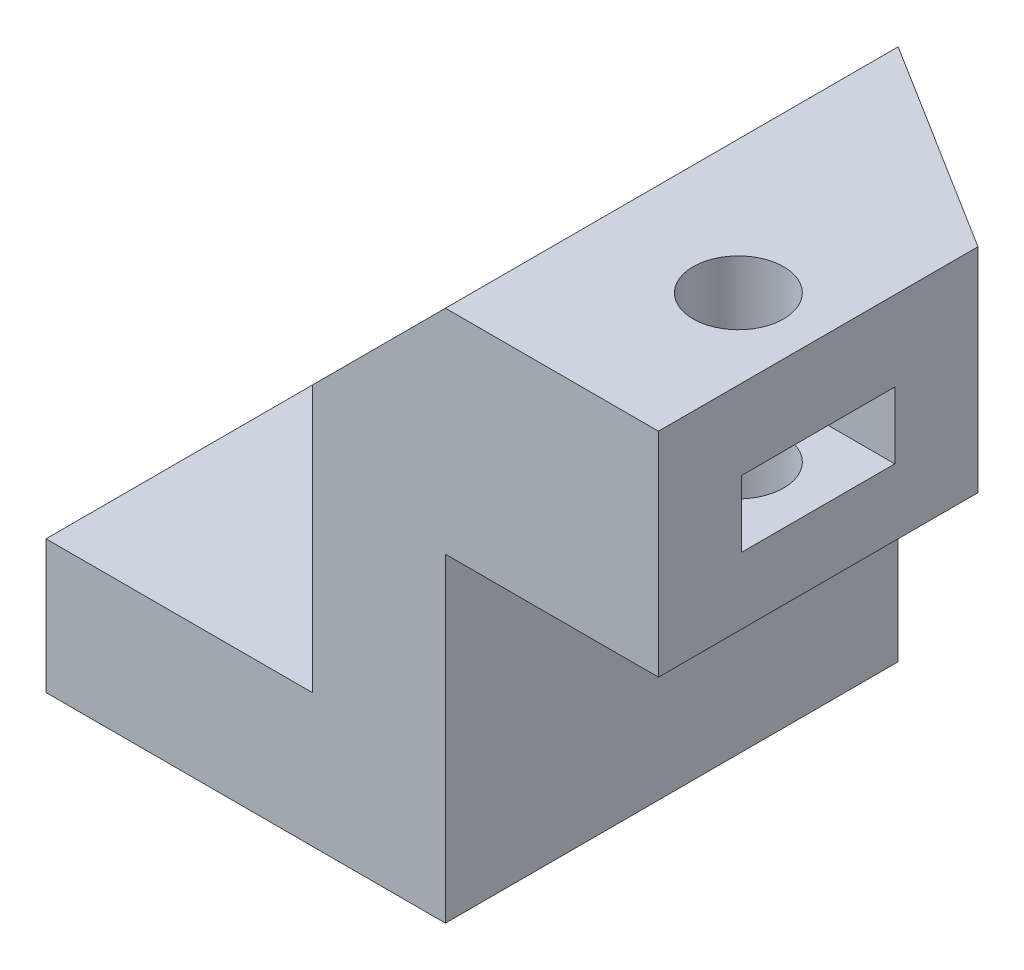
ISO-10303-21;
HEADER;
FILE_DESCRIPTION(('STEP AP214'),'2;1');
FILE_NAME('part.step','',(''),(''),'','','');
FILE_SCHEMA(('AUTOMOTIVE_DESIGN { 1 0 10303 214 1 1 1 1 }'));
ENDSEC;
DATA;
#1=APPLICATION_CONTEXT('core data for automotive mechanical design processes');
#2=APPLICATION_PROTOCOL_DEFINITION('international standard','automotive_design',2000,#1);
#3=PRODUCT_CONTEXT('',#1,'mechanical');
#4=PRODUCT('Part','Part','',(#3));
#5=PRODUCT_RELATED_PRODUCT_CATEGORY('part','',(#4));
#6=PRODUCT_DEFINITION_FORMATION('','',#4);
#7=PRODUCT_DEFINITION_CONTEXT('part definition',#1,'design');
#8=PRODUCT_DEFINITION('design','',#6,#7);
#9=PRODUCT_DEFINITION_SHAPE('','',#8);
#10=(LENGTH_UNIT() NAMED_UNIT(*) SI_UNIT(.MILLI.,.METRE.));
#11=(NAMED_UNIT(*) PLANE_ANGLE_UNIT() SI_UNIT($,.RADIAN.));
#12=(NAMED_UNIT(*) SI_UNIT($,.STERADIAN.) SOLID_ANGLE_UNIT());
#13=UNCERTAINTY_MEASURE_WITH_UNIT(LENGTH_MEASURE(1.E-05),#10,'distance_accuracy_value','');
#14=(GEOMETRIC_REPRESENTATION_CONTEXT(3) GLOBAL_UNCERTAINTY_ASSIGNED_CONTEXT((#13)) GLOBAL_UNIT_ASSIGNED_CONTEXT((#10,
#11,#12)) REPRESENTATION_CONTEXT('',''));
#15=CARTESIAN_POINT('',(0.,0.,0.));
#16=DIRECTION('',(0.,0.,1.));
#17=DIRECTION('',(1.,0.,0.));
#18=AXIS2_PLACEMENT_3D('',#15,#16,#17);
#19=CARTESIAN_POINT('',(23.,12.,-17.));
#20=DIRECTION('',(1.,0.,0.));
#21=DIRECTION('',(0.,0.,-1.));
#22=AXIS2_PLACEMENT_3D('',#19,#20,#21);
#23=PLANE('',#22);
#24=DIRECTION('',(0.,0.,1.));
#25=VECTOR('',#24,1.);
#26=CARTESIAN_POINT('',(23.,12.,-17.));
#27=LINE('',#26,#25);
#28=CARTESIAN_POINT('',(23.,12.,-12.));
#29=VERTEX_POINT('',#28);
#30=CARTESIAN_POINT('',(23.,12.,0.));
#31=VERTEX_POINT('',#30);
#32=EDGE_CURVE('E244',#29,#31,#27,.T.);
#33=ORIENTED_EDGE('',*,*,#32,.F.);
#34=DIRECTION('',(0.,1.,0.));
#35=VECTOR('',#34,1.);
#36=CARTESIAN_POINT('',(23.,20.,-12.));
#37=LINE('',#36,#35);
#38=CARTESIAN_POINT('',(23.,20.,-12.));
#39=VERTEX_POINT('',#38);
#40=EDGE_CURVE('E243',#29,#39,#37,.T.);
#41=ORIENTED_EDGE('',*,*,#40,.T.);
#42=DIRECTION('',(0.,0.,1.));
#43=VECTOR('',#42,1.);
#44=CARTESIAN_POINT('',(23.,20.,-17.));
#45=LINE('',#44,#43);
#46=CARTESIAN_POINT('',(23.,20.,0.));
#47=VERTEX_POINT('',#46);
#48=EDGE_CURVE('E241',#39,#47,#45,.T.);
#49=ORIENTED_EDGE('',*,*,#48,.T.);
#50=DIRECTION('',(0.,1.,0.));
#51=VECTOR('',#50,1.);
#52=CARTESIAN_POINT('',(23.,12.,0.));
#53=LINE('',#52,#51);
#54=EDGE_CURVE('E200',#31,#47,#53,.T.);
#55=ORIENTED_EDGE('',*,*,#54,.F.);
#56=EDGE_LOOP('',(#33,#41,#49,#55));
#57=FACE_BOUND('',#56,.T.);
#58=DIRECTION('',(0.,1.,0.));
#59=VECTOR('',#58,1.);
#60=CARTESIAN_POINT('',(23.,14.5,-8.875));
#61=LINE('',#60,#59);
#62=CARTESIAN_POINT('',(23.,14.5,-8.875));
#63=VERTEX_POINT('',#62);
#64=CARTESIAN_POINT('',(23.,17.,-8.875));
#65=VERTEX_POINT('',#64);
#66=EDGE_CURVE('E179',#63,#65,#61,.T.);
#67=ORIENTED_EDGE('',*,*,#66,.F.);
#68=DIRECTION('',(0.,0.,-1.));
#69=VECTOR('',#68,1.);
#70=CARTESIAN_POINT('',(23.,14.5,-8.875));
#71=LINE('',#70,#69);
#72=CARTESIAN_POINT('',(23.,14.5,-3.125));
#73=VERTEX_POINT('',#72);
#74=EDGE_CURVE('E165',#73,#63,#71,.T.);
#75=ORIENTED_EDGE('',*,*,#74,.F.);
#76=DIRECTION('',(0.,1.,0.));
#77=VECTOR('',#76,1.);
#78=CARTESIAN_POINT('',(23.,14.5,-3.125));
#79=LINE('',#78,#77);
#80=CARTESIAN_POINT('',(23.,17.,-3.125));
#81=VERTEX_POINT('',#80);
#82=EDGE_CURVE('E181',#73,#81,#79,.T.);
#83=ORIENTED_EDGE('',*,*,#82,.T.);
#84=DIRECTION('',(0.,0.,-1.));
#85=VECTOR('',#84,1.);
#86=CARTESIAN_POINT('',(23.,17.,-8.875));
#87=LINE('',#86,#85);
#88=EDGE_CURVE('E161',#81,#65,#87,.T.);
#89=ORIENTED_EDGE('',*,*,#88,.T.);
#90=EDGE_LOOP('',(#67,#75,#83,#89));
#91=FACE_BOUND('',#90,.T.);
#92=ADVANCED_FACE('F32',(#57,#91),#23,.T.);
#93=CARTESIAN_POINT('',(20.,0.,-5.99999999999999));
#94=DIRECTION('',(0.,1.,0.));
#95=DIRECTION('',(-1.,0.,0.));
#96=AXIS2_PLACEMENT_3D('',#93,#94,#95);
#97=CYLINDRICAL_SURFACE('',#96,1.7);
#98=CARTESIAN_POINT('',(20.,12.,-5.99999999999999));
#99=DIRECTION('',(0.,-1.,0.));
#100=DIRECTION('',(0.,0.,-1.));
#101=AXIS2_PLACEMENT_3D('',#98,#99,#100);
#102=CIRCLE('',#101,1.7);
#103=CARTESIAN_POINT('',(20.,12.,-7.69999999999999));
#104=VERTEX_POINT('',#103);
#105=EDGE_CURVE('E188',#104,#104,#102,.T.);
#106=ORIENTED_EDGE('',*,*,#105,.T.);
#107=EDGE_LOOP('',(#106));
#108=FACE_BOUND('',#107,.T.);
#109=CARTESIAN_POINT('',(20.,14.5,-5.99999999999999));
#110=DIRECTION('',(0.,1.,0.));
#111=DIRECTION('',(0.,0.,1.));
#112=AXIS2_PLACEMENT_3D('',#109,#110,#111);
#113=CIRCLE('',#112,1.7);
#114=CARTESIAN_POINT('',(20.,14.5,-4.3));
#115=VERTEX_POINT('',#114);
#116=EDGE_CURVE('E36',#115,#115,#113,.F.);
#117=ORIENTED_EDGE('',*,*,#116,.F.);
#118=EDGE_LOOP('',(#117));
#119=FACE_BOUND('',#118,.T.);
#120=ADVANCED_FACE('F269',(#108,#119),#97,.F.);
#121=CARTESIAN_POINT('',(23.,20.,-17.));
#122=DIRECTION('',(0.,1.,0.));
#123=DIRECTION('',(-1.,0.,0.));
#124=AXIS2_PLACEMENT_3D('',#121,#122,#123);
#125=PLANE('',#124);
#126=CARTESIAN_POINT('',(20.,20.,-5.99999999999999));
#127=DIRECTION('',(0.,1.,0.));
#128=DIRECTION('',(-1.,0.,0.));
#129=AXIS2_PLACEMENT_3D('',#126,#127,#128);
#130=CIRCLE('',#129,1.7);
#131=CARTESIAN_POINT('',(18.3,20.,-5.99999999999999));
#132=VERTEX_POINT('',#131);
#133=EDGE_CURVE('E185',#132,#132,#130,.T.);
#134=ORIENTED_EDGE('',*,*,#133,.F.);
#135=EDGE_LOOP('',(#134));
#136=FACE_BOUND('',#135,.T.);
#137=ORIENTED_EDGE('',*,*,#48,.F.);
#138=DIRECTION('',(-0.847998304005089,0.,-0.529998940003179));
#139=VECTOR('',#138,1.);
#140=CARTESIAN_POINT('',(20.752808988764,20.,-13.4044943820225));
#141=LINE('',#140,#139);
#142=CARTESIAN_POINT('',(15.,20.,-17.));
#143=VERTEX_POINT('',#142);
#144=EDGE_CURVE('E57',#39,#143,#141,.T.);
#145=ORIENTED_EDGE('',*,*,#144,.T.);
#146=DIRECTION('',(0.,0.,1.));
#147=VECTOR('',#146,1.);
#148=CARTESIAN_POINT('',(15.,20.,-17.));
#149=LINE('',#148,#147);
#150=CARTESIAN_POINT('',(15.,20.,0.));
#151=VERTEX_POINT('',#150);
#152=EDGE_CURVE('E215',#143,#151,#149,.T.);
#153=ORIENTED_EDGE('',*,*,#152,.T.);
#154=DIRECTION('',(-1.,0.,0.));
#155=VECTOR('',#154,1.);
#156=CARTESIAN_POINT('',(23.,20.,0.));
#157=LINE('',#156,#155);
#158=EDGE_CURVE('E195',#47,#151,#157,.T.);
#159=ORIENTED_EDGE('',*,*,#158,.F.);
#160=EDGE_LOOP('',(#137,#145,#153,#159));
#161=FACE_BOUND('',#160,.T.);
#162=ADVANCED_FACE('F271',(#136,#161),#125,.T.);
#163=CARTESIAN_POINT('',(15.,12.,-17.));
#164=DIRECTION('',(0.,-1.,0.));
#165=DIRECTION('',(0.,0.,-1.));
#166=AXIS2_PLACEMENT_3D('',#163,#164,#165);
#167=PLANE('',#166);
#168=ORIENTED_EDGE('',*,*,#105,.F.);
#169=EDGE_LOOP('',(#168));
#170=FACE_BOUND('',#169,.T.);
#171=DIRECTION('',(0.,0.,1.));
#172=VECTOR('',#171,1.);
#173=CARTESIAN_POINT('',(15.,12.,-17.));
#174=LINE('',#173,#172);
#175=CARTESIAN_POINT('',(15.,12.,-17.));
#176=VERTEX_POINT('',#175);
#177=CARTESIAN_POINT('',(15.,12.,0.));
#178=VERTEX_POINT('',#177);
#179=EDGE_CURVE('E246',#176,#178,#174,.T.);
#180=ORIENTED_EDGE('',*,*,#179,.F.);
#181=DIRECTION('',(0.847998304005089,0.,0.529998940003179));
#182=VECTOR('',#181,1.);
#183=CARTESIAN_POINT('',(15.,12.,-17.));
#184=LINE('',#183,#182);
#185=EDGE_CURVE('E11',#176,#29,#184,.T.);
#186=ORIENTED_EDGE('',*,*,#185,.T.);
#187=ORIENTED_EDGE('',*,*,#32,.T.);
#188=DIRECTION('',(1.,0.,0.));
#189=VECTOR('',#188,1.);
#190=CARTESIAN_POINT('',(15.,12.,0.));
#191=LINE('',#190,#189);
#192=EDGE_CURVE('E236',#178,#31,#191,.T.);
#193=ORIENTED_EDGE('',*,*,#192,.F.);
#194=EDGE_LOOP('',(#180,#186,#187,#193));
#195=FACE_BOUND('',#194,.T.);
#196=ADVANCED_FACE('F279',(#170,#195),#167,.T.);
#197=CARTESIAN_POINT('',(15.,0.,-17.));
#198=DIRECTION('',(1.,0.,0.));
#199=DIRECTION('',(0.,0.,-1.));
#200=AXIS2_PLACEMENT_3D('',#197,#198,#199);
#201=PLANE('',#200);
#202=DIRECTION('',(0.,1.,0.));
#203=VECTOR('',#202,1.);
#204=CARTESIAN_POINT('',(15.,0.,0.));
#205=LINE('',#204,#203);
#206=CARTESIAN_POINT('',(15.,0.,0.));
#207=VERTEX_POINT('',#206);
#208=EDGE_CURVE('E233',#207,#178,#205,.T.);
#209=ORIENTED_EDGE('',*,*,#208,.F.);
#210=DIRECTION('',(0.,0.,1.));
#211=VECTOR('',#210,1.);
#212=CARTESIAN_POINT('',(15.,0.,-17.));
#213=LINE('',#212,#211);
#214=CARTESIAN_POINT('',(15.,0.,-17.));
#215=VERTEX_POINT('',#214);
#216=EDGE_CURVE('E248',#215,#207,#213,.T.);
#217=ORIENTED_EDGE('',*,*,#216,.F.);
#218=DIRECTION('',(0.,1.,0.));
#219=VECTOR('',#218,1.);
#220=CARTESIAN_POINT('',(15.,0.,-17.));
#221=LINE('',#220,#219);
#222=EDGE_CURVE('E212',#215,#176,#221,.T.);
#223=ORIENTED_EDGE('',*,*,#222,.T.);
#224=ORIENTED_EDGE('',*,*,#179,.T.);
#225=EDGE_LOOP('',(#209,#217,#223,#224));
#226=FACE_BOUND('',#225,.T.);
#227=ADVANCED_FACE('F309',(#226),#201,.T.);
#228=CARTESIAN_POINT('',(0.,0.,-17.));
#229=DIRECTION('',(0.,-1.,0.));
#230=DIRECTION('',(0.,0.,-1.));
#231=AXIS2_PLACEMENT_3D('',#228,#229,#230);
#232=PLANE('',#231);
#233=CARTESIAN_POINT('',(5.,0.,-10.));
#234=DIRECTION('',(0.,-1.,0.));
#235=DIRECTION('',(0.,0.,-1.));
#236=AXIS2_PLACEMENT_3D('',#233,#234,#235);
#237=CIRCLE('',#236,2.6);
#238=CARTESIAN_POINT('',(5.,0.,-12.6));
#239=VERTEX_POINT('',#238);
#240=EDGE_CURVE('E192',#239,#239,#237,.T.);
#241=ORIENTED_EDGE('',*,*,#240,.F.);
#242=EDGE_LOOP('',(#241));
#243=FACE_BOUND('',#242,.T.);
#244=DIRECTION('',(1.,0.,0.));
#245=VECTOR('',#244,1.);
#246=CARTESIAN_POINT('',(0.,0.,0.));
#247=LINE('',#246,#245);
#248=CARTESIAN_POINT('',(0.,0.,0.));
#249=VERTEX_POINT('',#248);
#250=EDGE_CURVE('E230',#249,#207,#247,.T.);
#251=ORIENTED_EDGE('',*,*,#250,.F.);
#252=DIRECTION('',(0.,0.,1.));
#253=VECTOR('',#252,1.);
#254=CARTESIAN_POINT('',(0.,0.,-17.));
#255=LINE('',#254,#253);
#256=CARTESIAN_POINT('',(0.,0.,-17.));
#257=VERTEX_POINT('',#256);
#258=EDGE_CURVE('E250',#257,#249,#255,.T.);
#259=ORIENTED_EDGE('',*,*,#258,.F.);
#260=DIRECTION('',(1.,0.,0.));
#261=VECTOR('',#260,1.);
#262=CARTESIAN_POINT('',(0.,0.,-17.));
#263=LINE('',#262,#261);
#264=EDGE_CURVE('E209',#257,#215,#263,.T.);
#265=ORIENTED_EDGE('',*,*,#264,.T.);
#266=ORIENTED_EDGE('',*,*,#216,.T.);
#267=EDGE_LOOP('',(#251,#259,#265,#266));
#268=FACE_BOUND('',#267,.T.);
#269=ADVANCED_FACE('F317',(#243,#268),#232,.T.);
#270=CARTESIAN_POINT('',(0.,5.,-17.));
#271=DIRECTION('',(-1.,0.,0.));
#272=DIRECTION('',(0.,0.,1.));
#273=AXIS2_PLACEMENT_3D('',#270,#271,#272);
#274=PLANE('',#273);
#275=DIRECTION('',(0.,-1.,0.));
#276=VECTOR('',#275,1.);
#277=CARTESIAN_POINT('',(0.,5.,0.));
#278=LINE('',#277,#276);
#279=CARTESIAN_POINT('',(0.,5.,0.));
#280=VERTEX_POINT('',#279);
#281=EDGE_CURVE('E227',#280,#249,#278,.T.);
#282=ORIENTED_EDGE('',*,*,#281,.F.);
#283=DIRECTION('',(0.,0.,1.));
#284=VECTOR('',#283,1.);
#285=CARTESIAN_POINT('',(0.,5.,-17.));
#286=LINE('',#285,#284);
#287=CARTESIAN_POINT('',(0.,5.,-17.));
#288=VERTEX_POINT('',#287);
#289=EDGE_CURVE('E252',#288,#280,#286,.T.);
#290=ORIENTED_EDGE('',*,*,#289,.F.);
#291=DIRECTION('',(0.,-1.,0.));
#292=VECTOR('',#291,1.);
#293=CARTESIAN_POINT('',(0.,5.,-17.));
#294=LINE('',#293,#292);
#295=EDGE_CURVE('E206',#288,#257,#294,.T.);
#296=ORIENTED_EDGE('',*,*,#295,.T.);
#297=ORIENTED_EDGE('',*,*,#258,.T.);
#298=EDGE_LOOP('',(#282,#290,#296,#297));
#299=FACE_BOUND('',#298,.T.);
#300=ADVANCED_FACE('F320',(#299),#274,.T.);
#301=CARTESIAN_POINT('',(10.,5.,-17.));
#302=DIRECTION('',(0.,1.,0.));
#303=DIRECTION('',(-1.,0.,0.));
#304=AXIS2_PLACEMENT_3D('',#301,#302,#303);
#305=PLANE('',#304);
#306=CARTESIAN_POINT('',(5.,5.,-10.));
#307=DIRECTION('',(0.,1.,0.));
#308=DIRECTION('',(-1.,0.,0.));
#309=AXIS2_PLACEMENT_3D('',#306,#307,#308);
#310=CIRCLE('',#309,2.6);
#311=CARTESIAN_POINT('',(2.4,5.,-10.));
#312=VERTEX_POINT('',#311);
#313=EDGE_CURVE('E189',#312,#312,#310,.T.);
#314=ORIENTED_EDGE('',*,*,#313,.F.);
#315=EDGE_LOOP('',(#314));
#316=FACE_BOUND('',#315,.T.);
#317=DIRECTION('',(-1.,0.,0.));
#318=VECTOR('',#317,1.);
#319=CARTESIAN_POINT('',(10.,5.,0.));
#320=LINE('',#319,#318);
#321=CARTESIAN_POINT('',(10.,5.,0.));
#322=VERTEX_POINT('',#321);
#323=EDGE_CURVE('E224',#322,#280,#320,.T.);
#324=ORIENTED_EDGE('',*,*,#323,.F.);
#325=DIRECTION('',(0.,0.,1.));
#326=VECTOR('',#325,1.);
#327=CARTESIAN_POINT('',(10.,5.,-17.));
#328=LINE('',#327,#326);
#329=CARTESIAN_POINT('',(10.,5.,-17.));
#330=VERTEX_POINT('',#329);
#331=EDGE_CURVE('E254',#330,#322,#328,.T.);
#332=ORIENTED_EDGE('',*,*,#331,.F.);
#333=DIRECTION('',(-1.,0.,0.));
#334=VECTOR('',#333,1.);
#335=CARTESIAN_POINT('',(10.,5.,-17.));
#336=LINE('',#335,#334);
#337=EDGE_CURVE('E203',#330,#288,#336,.T.);
#338=ORIENTED_EDGE('',*,*,#337,.T.);
#339=ORIENTED_EDGE('',*,*,#289,.T.);
#340=EDGE_LOOP('',(#324,#332,#338,#339));
#341=FACE_BOUND('',#340,.T.);
#342=ADVANCED_FACE('F325',(#316,#341),#305,.T.);
#343=CARTESIAN_POINT('',(10.,15.,-17.));
#344=DIRECTION('',(-1.,0.,0.));
#345=DIRECTION('',(0.,0.,1.));
#346=AXIS2_PLACEMENT_3D('',#343,#344,#345);
#347=PLANE('',#346);
#348=DIRECTION('',(0.,-1.,0.));
#349=VECTOR('',#348,1.);
#350=CARTESIAN_POINT('',(10.,15.,0.));
#351=LINE('',#350,#349);
#352=CARTESIAN_POINT('',(10.,15.,0.));
#353=VERTEX_POINT('',#352);
#354=EDGE_CURVE('E221',#353,#322,#351,.T.);
#355=ORIENTED_EDGE('',*,*,#354,.F.);
#356=DIRECTION('',(0.,0.,1.));
#357=VECTOR('',#356,1.);
#358=CARTESIAN_POINT('',(10.,15.,-17.));
#359=LINE('',#358,#357);
#360=CARTESIAN_POINT('',(10.,15.,-17.));
#361=VERTEX_POINT('',#360);
#362=EDGE_CURVE('E256',#361,#353,#359,.T.);
#363=ORIENTED_EDGE('',*,*,#362,.F.);
#364=DIRECTION('',(0.,-1.,0.));
#365=VECTOR('',#364,1.);
#366=CARTESIAN_POINT('',(10.,15.,-17.));
#367=LINE('',#366,#365);
#368=EDGE_CURVE('E199',#361,#330,#367,.T.);
#369=ORIENTED_EDGE('',*,*,#368,.T.);
#370=ORIENTED_EDGE('',*,*,#331,.T.);
#371=EDGE_LOOP('',(#355,#363,#369,#370));
#372=FACE_BOUND('',#371,.T.);
#373=ADVANCED_FACE('F328',(#372),#347,.T.);
#374=CARTESIAN_POINT('',(15.,20.,-17.));
#375=DIRECTION('',(-0.707106781186549,0.707106781186546,0.));
#376=DIRECTION('',(-0.707106781186546,-0.707106781186549,0.));
#377=AXIS2_PLACEMENT_3D('',#374,#375,#376);
#378=PLANE('',#377);
#379=DIRECTION('',(-0.707106781186546,-0.707106781186549,0.));
#380=VECTOR('',#379,1.);
#381=CARTESIAN_POINT('',(15.,20.,0.));
#382=LINE('',#381,#380);
#383=EDGE_CURVE('E218',#151,#353,#382,.T.);
#384=ORIENTED_EDGE('',*,*,#383,.F.);
#385=ORIENTED_EDGE('',*,*,#152,.F.);
#386=DIRECTION('',(-0.707106781186546,-0.707106781186549,0.));
#387=VECTOR('',#386,1.);
#388=CARTESIAN_POINT('',(15.,20.,-17.));
#389=LINE('',#388,#387);
#390=EDGE_CURVE('E196',#143,#361,#389,.T.);
#391=ORIENTED_EDGE('',*,*,#390,.T.);
#392=ORIENTED_EDGE('',*,*,#362,.T.);
#393=EDGE_LOOP('',(#384,#385,#391,#392));
#394=FACE_BOUND('',#393,.T.);
#395=ADVANCED_FACE('F331',(#394),#378,.T.);
#396=CARTESIAN_POINT('',(0.,0.,-17.));
#397=DIRECTION('',(0.,0.,1.));
#398=DIRECTION('',(1.,0.,0.));
#399=AXIS2_PLACEMENT_3D('',#396,#397,#398);
#400=PLANE('',#399);
#401=ORIENTED_EDGE('',*,*,#390,.F.);
#402=DIRECTION('',(0.,-1.,0.));
#403=VECTOR('',#402,1.);
#404=CARTESIAN_POINT('',(15.,12.,-17.));
#405=LINE('',#404,#403);
#406=EDGE_CURVE('E41',#143,#176,#405,.T.);
#407=ORIENTED_EDGE('',*,*,#406,.T.);
#408=ORIENTED_EDGE('',*,*,#222,.F.);
#409=ORIENTED_EDGE('',*,*,#264,.F.);
#410=ORIENTED_EDGE('',*,*,#295,.F.);
#411=ORIENTED_EDGE('',*,*,#337,.F.);
#412=ORIENTED_EDGE('',*,*,#368,.F.);
#413=EDGE_LOOP('',(#401,#407,#408,#409,#410,#411,#412));
#414=FACE_BOUND('',#413,.T.);
#415=ADVANCED_FACE('F313',(#414),#400,.F.);
#416=CARTESIAN_POINT('',(0.,0.,0.));
#417=DIRECTION('',(0.,0.,1.));
#418=DIRECTION('',(1.,0.,0.));
#419=AXIS2_PLACEMENT_3D('',#416,#417,#418);
#420=PLANE('',#419);
#421=ORIENTED_EDGE('',*,*,#158,.T.);
#422=ORIENTED_EDGE('',*,*,#383,.T.);
#423=ORIENTED_EDGE('',*,*,#354,.T.);
#424=ORIENTED_EDGE('',*,*,#323,.T.);
#425=ORIENTED_EDGE('',*,*,#281,.T.);
#426=ORIENTED_EDGE('',*,*,#250,.T.);
#427=ORIENTED_EDGE('',*,*,#208,.T.);
#428=ORIENTED_EDGE('',*,*,#192,.T.);
#429=ORIENTED_EDGE('',*,*,#54,.T.);
#430=EDGE_LOOP('',(#421,#422,#423,#424,#425,#426,#427,#428,#429));
#431=FACE_BOUND('',#430,.T.);
#432=ADVANCED_FACE('F333',(#431),#420,.T.);
#433=CARTESIAN_POINT('',(5.,-15.,-10.));
#434=DIRECTION('',(0.,1.,0.));
#435=DIRECTION('',(-1.,0.,0.));
#436=AXIS2_PLACEMENT_3D('',#433,#434,#435);
#437=CYLINDRICAL_SURFACE('',#436,2.6);
#438=ORIENTED_EDGE('',*,*,#240,.T.);
#439=EDGE_LOOP('',(#438));
#440=FACE_BOUND('',#439,.T.);
#441=ORIENTED_EDGE('',*,*,#313,.T.);
#442=EDGE_LOOP('',(#441));
#443=FACE_BOUND('',#442,.T.);
#444=ADVANCED_FACE('F292',(#440,#443),#437,.F.);
#445=CARTESIAN_POINT('',(23.,12.,-12.));
#446=DIRECTION('',(0.529998940003179,0.,-0.847998304005089));
#447=DIRECTION('',(0.,-1.,0.));
#448=AXIS2_PLACEMENT_3D('',#445,#446,#447);
#449=PLANE('',#448);
#450=ORIENTED_EDGE('',*,*,#185,.F.);
#451=ORIENTED_EDGE('',*,*,#406,.F.);
#452=ORIENTED_EDGE('',*,*,#144,.F.);
#453=ORIENTED_EDGE('',*,*,#40,.F.);
#454=EDGE_LOOP('',(#450,#451,#452,#453));
#455=FACE_BOUND('',#454,.T.);
#456=ADVANCED_FACE('F34',(#455),#449,.T.);
#457=CARTESIAN_POINT('',(20.,17.,-5.99999999999999));
#458=DIRECTION('',(0.,1.,0.));
#459=DIRECTION('',(0.,0.,1.));
#460=AXIS2_PLACEMENT_3D('',#457,#458,#459);
#461=CIRCLE('',#460,1.7);
#462=CARTESIAN_POINT('',(20.,17.,-4.3));
#463=VERTEX_POINT('',#462);
#464=EDGE_CURVE('E178',#463,#463,#461,.F.);
#465=ORIENTED_EDGE('',*,*,#464,.T.);
#466=EDGE_LOOP('',(#465));
#467=FACE_BOUND('',#466,.T.);
#468=ORIENTED_EDGE('',*,*,#133,.T.);
#469=EDGE_LOOP('',(#468));
#470=FACE_BOUND('',#469,.T.);
#471=ADVANCED_FACE('F274',(#467,#470),#97,.F.);
#472=CARTESIAN_POINT('',(0.,14.5,0.));
#473=DIRECTION('',(0.,1.,0.));
#474=DIRECTION('',(0.,0.,1.));
#475=AXIS2_PLACEMENT_3D('',#472,#473,#474);
#476=PLANE('',#475);
#477=DIRECTION('',(-0.500000000000001,0.,0.866025403784438));
#478=VECTOR('',#477,1.);
#479=CARTESIAN_POINT('',(18.3401179760798,14.5,-8.875));
#480=LINE('',#479,#478);
#481=CARTESIAN_POINT('',(18.3401179760798,14.5,-8.875));
#482=VERTEX_POINT('',#481);
#483=CARTESIAN_POINT('',(16.6802359521597,14.5,-5.99999999999999));
#484=VERTEX_POINT('',#483);
#485=EDGE_CURVE('E140',#482,#484,#480,.T.);
#486=ORIENTED_EDGE('',*,*,#485,.T.);
#487=DIRECTION('',(0.500000000000001,0.,0.866025403784438));
#488=VECTOR('',#487,1.);
#489=CARTESIAN_POINT('',(16.6802359521597,14.5,-5.99999999999999));
#490=LINE('',#489,#488);
#491=CARTESIAN_POINT('',(18.3401179760798,14.5,-3.125));
#492=VERTEX_POINT('',#491);
#493=EDGE_CURVE('E150',#484,#492,#490,.T.);
#494=ORIENTED_EDGE('',*,*,#493,.T.);
#495=DIRECTION('',(1.,0.,0.));
#496=VECTOR('',#495,1.);
#497=CARTESIAN_POINT('',(18.3401179760798,14.5,-3.125));
#498=LINE('',#497,#496);
#499=EDGE_CURVE('E155',#492,#73,#498,.T.);
#500=ORIENTED_EDGE('',*,*,#499,.T.);
#501=ORIENTED_EDGE('',*,*,#74,.T.);
#502=DIRECTION('',(-1.,0.,0.));
#503=VECTOR('',#502,1.);
#504=CARTESIAN_POINT('',(23.,14.5,-8.875));
#505=LINE('',#504,#503);
#506=EDGE_CURVE('E147',#63,#482,#505,.T.);
#507=ORIENTED_EDGE('',*,*,#506,.T.);
#508=EDGE_LOOP('',(#486,#494,#500,#501,#507));
#509=FACE_BOUND('',#508,.T.);
#510=ORIENTED_EDGE('',*,*,#116,.T.);
#511=EDGE_LOOP('',(#510));
#512=FACE_BOUND('',#511,.T.);
#513=ADVANCED_FACE('F157',(#509,#512),#476,.T.);
#514=CARTESIAN_POINT('',(0.,17.,0.));
#515=DIRECTION('',(0.,1.,0.));
#516=DIRECTION('',(0.,0.,1.));
#517=AXIS2_PLACEMENT_3D('',#514,#515,#516);
#518=PLANE('',#517);
#519=DIRECTION('',(-0.500000000000001,0.,0.866025403784438));
#520=VECTOR('',#519,1.);
#521=CARTESIAN_POINT('',(18.3401179760798,17.,-8.875));
#522=LINE('',#521,#520);
#523=CARTESIAN_POINT('',(18.3401179760798,17.,-8.875));
#524=VERTEX_POINT('',#523);
#525=CARTESIAN_POINT('',(16.6802359521597,17.,-5.99999999999999));
#526=VERTEX_POINT('',#525);
#527=EDGE_CURVE('E142',#524,#526,#522,.T.);
#528=ORIENTED_EDGE('',*,*,#527,.F.);
#529=DIRECTION('',(-1.,0.,0.));
#530=VECTOR('',#529,1.);
#531=CARTESIAN_POINT('',(23.,17.,-8.875));
#532=LINE('',#531,#530);
#533=EDGE_CURVE('E49',#65,#524,#532,.T.);
#534=ORIENTED_EDGE('',*,*,#533,.F.);
#535=ORIENTED_EDGE('',*,*,#88,.F.);
#536=DIRECTION('',(1.,0.,0.));
#537=VECTOR('',#536,1.);
#538=CARTESIAN_POINT('',(18.3401179760798,17.,-3.125));
#539=LINE('',#538,#537);
#540=CARTESIAN_POINT('',(18.3401179760798,17.,-3.125));
#541=VERTEX_POINT('',#540);
#542=EDGE_CURVE('E171',#541,#81,#539,.T.);
#543=ORIENTED_EDGE('',*,*,#542,.F.);
#544=DIRECTION('',(0.500000000000001,0.,0.866025403784438));
#545=VECTOR('',#544,1.);
#546=CARTESIAN_POINT('',(16.6802359521597,17.,-5.99999999999999));
#547=LINE('',#546,#545);
#548=EDGE_CURVE('E169',#526,#541,#547,.T.);
#549=ORIENTED_EDGE('',*,*,#548,.F.);
#550=EDGE_LOOP('',(#528,#534,#535,#543,#549));
#551=FACE_BOUND('',#550,.T.);
#552=ORIENTED_EDGE('',*,*,#464,.F.);
#553=EDGE_LOOP('',(#552));
#554=FACE_BOUND('',#553,.T.);
#555=ADVANCED_FACE('F290',(#551,#554),#518,.F.);
#556=CARTESIAN_POINT('',(18.3401179760798,14.5,-8.875));
#557=DIRECTION('',(-0.866025403784438,0.,-0.500000000000001));
#558=DIRECTION('',(-0.500000000000001,0.,0.866025403784438));
#559=AXIS2_PLACEMENT_3D('',#556,#557,#558);
#560=PLANE('',#559);
#561=ORIENTED_EDGE('',*,*,#527,.T.);
#562=DIRECTION('',(0.,1.,0.));
#563=VECTOR('',#562,1.);
#564=CARTESIAN_POINT('',(16.6802359521597,14.5,-5.99999999999999));
#565=LINE('',#564,#563);
#566=EDGE_CURVE('E136',#484,#526,#565,.T.);
#567=ORIENTED_EDGE('',*,*,#566,.F.);
#568=ORIENTED_EDGE('',*,*,#485,.F.);
#569=DIRECTION('',(0.,1.,0.));
#570=VECTOR('',#569,1.);
#571=CARTESIAN_POINT('',(18.3401179760798,14.5,-8.875));
#572=LINE('',#571,#570);
#573=EDGE_CURVE('E176',#482,#524,#572,.T.);
#574=ORIENTED_EDGE('',*,*,#573,.T.);
#575=EDGE_LOOP('',(#561,#567,#568,#574));
#576=FACE_BOUND('',#575,.T.);
#577=ADVANCED_FACE('F138',(#576),#560,.F.);
#578=CARTESIAN_POINT('',(23.,14.5,-8.875));
#579=DIRECTION('',(0.,0.,-1.));
#580=DIRECTION('',(-1.,0.,0.));
#581=AXIS2_PLACEMENT_3D('',#578,#579,#580);
#582=PLANE('',#581);
#583=ORIENTED_EDGE('',*,*,#533,.T.);
#584=ORIENTED_EDGE('',*,*,#573,.F.);
#585=ORIENTED_EDGE('',*,*,#506,.F.);
#586=ORIENTED_EDGE('',*,*,#66,.T.);
#587=EDGE_LOOP('',(#583,#584,#585,#586));
#588=FACE_BOUND('',#587,.T.);
#589=ADVANCED_FACE('F426',(#588),#582,.F.);
#590=CARTESIAN_POINT('',(18.3401179760798,14.5,-3.125));
#591=DIRECTION('',(0.,0.,1.));
#592=DIRECTION('',(1.,0.,0.));
#593=AXIS2_PLACEMENT_3D('',#590,#591,#592);
#594=PLANE('',#593);
#595=ORIENTED_EDGE('',*,*,#542,.T.);
#596=ORIENTED_EDGE('',*,*,#82,.F.);
#597=ORIENTED_EDGE('',*,*,#499,.F.);
#598=DIRECTION('',(0.,1.,0.));
#599=VECTOR('',#598,1.);
#600=CARTESIAN_POINT('',(18.3401179760798,14.5,-3.125));
#601=LINE('',#600,#599);
#602=EDGE_CURVE('E146',#492,#541,#601,.T.);
#603=ORIENTED_EDGE('',*,*,#602,.T.);
#604=EDGE_LOOP('',(#595,#596,#597,#603));
#605=FACE_BOUND('',#604,.T.);
#606=ADVANCED_FACE('F434',(#605),#594,.F.);
#607=CARTESIAN_POINT('',(16.6802359521597,14.5,-5.99999999999999));
#608=DIRECTION('',(-0.866025403784438,0.,0.500000000000001));
#609=DIRECTION('',(0.500000000000001,0.,0.866025403784438));
#610=AXIS2_PLACEMENT_3D('',#607,#608,#609);
#611=PLANE('',#610);
#612=ORIENTED_EDGE('',*,*,#548,.T.);
#613=ORIENTED_EDGE('',*,*,#602,.F.);
#614=ORIENTED_EDGE('',*,*,#493,.F.);
#615=ORIENTED_EDGE('',*,*,#566,.T.);
#616=EDGE_LOOP('',(#612,#613,#614,#615));
#617=FACE_BOUND('',#616,.T.);
#618=ADVANCED_FACE('F151',(#617),#611,.F.);
#619=CLOSED_SHELL('',(#92,#120,#162,#196,#227,#269,#300,#342,#373,#395,#415,#432,#444,#456,#471,
#513,#555,#577,#589,#606,#618));
#620=MANIFOLD_SOLID_BREP('B2',#619);
#621=ADVANCED_BREP_SHAPE_REPRESENTATION('',(#18,#620),#14);
#622=SHAPE_DEFINITION_REPRESENTATION(#9,#621);
ENDSEC;
END-ISO-10303-21;
